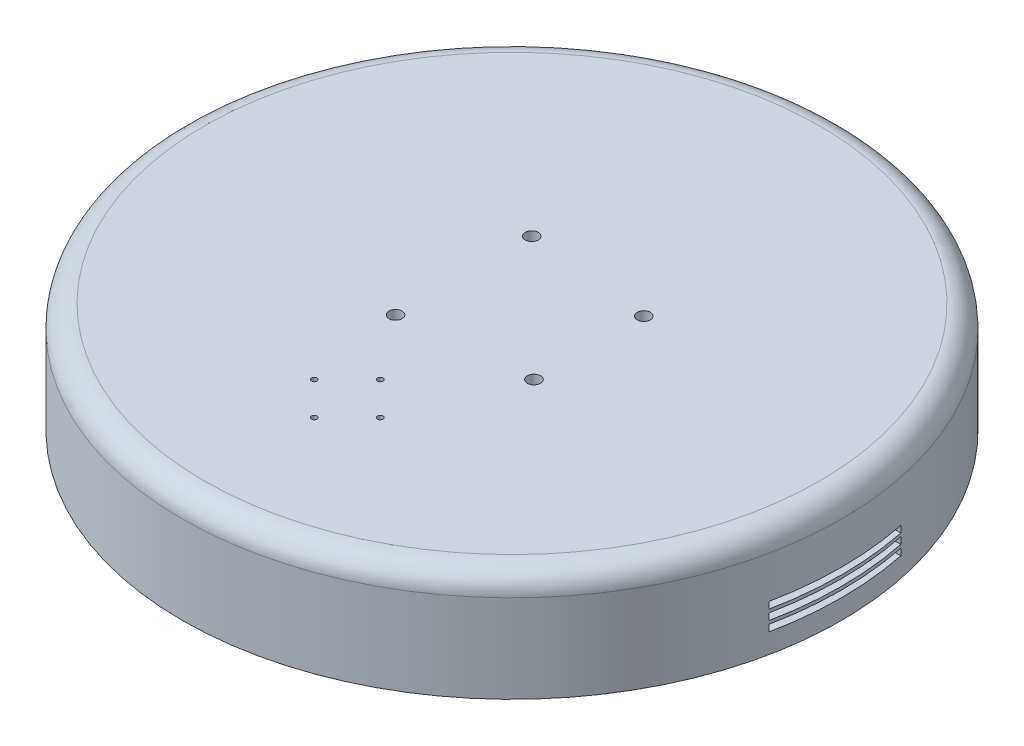
ISO-10303-21;
HEADER;
FILE_DESCRIPTION(('STEP AP214'),'2;1');
FILE_NAME('part.step','',(''),(''),'','','');
FILE_SCHEMA(('AUTOMOTIVE_DESIGN { 1 0 10303 214 1 1 1 1 }'));
ENDSEC;
DATA;
#1=APPLICATION_CONTEXT('core data for automotive mechanical design processes');
#2=APPLICATION_PROTOCOL_DEFINITION('international standard','automotive_design',2000,#1);
#3=PRODUCT_CONTEXT('',#1,'mechanical');
#4=PRODUCT('Part','Part','',(#3));
#5=PRODUCT_RELATED_PRODUCT_CATEGORY('part','',(#4));
#6=PRODUCT_DEFINITION_FORMATION('','',#4);
#7=PRODUCT_DEFINITION_CONTEXT('part definition',#1,'design');
#8=PRODUCT_DEFINITION('design','',#6,#7);
#9=PRODUCT_DEFINITION_SHAPE('','',#8);
#10=(LENGTH_UNIT() NAMED_UNIT(*) SI_UNIT(.MILLI.,.METRE.));
#11=(NAMED_UNIT(*) PLANE_ANGLE_UNIT() SI_UNIT($,.RADIAN.));
#12=(NAMED_UNIT(*) SI_UNIT($,.STERADIAN.) SOLID_ANGLE_UNIT());
#13=UNCERTAINTY_MEASURE_WITH_UNIT(LENGTH_MEASURE(1.E-05),#10,'distance_accuracy_value','');
#14=(GEOMETRIC_REPRESENTATION_CONTEXT(3) GLOBAL_UNCERTAINTY_ASSIGNED_CONTEXT((#13)) GLOBAL_UNIT_ASSIGNED_CONTEXT((#10,
#11,#12)) REPRESENTATION_CONTEXT('',''));
#15=CARTESIAN_POINT('',(0.,0.,0.));
#16=DIRECTION('',(0.,0.,1.));
#17=DIRECTION('',(1.,0.,0.));
#18=AXIS2_PLACEMENT_3D('',#15,#16,#17);
#19=CARTESIAN_POINT('',(0.,50.,0.));
#20=DIRECTION('',(0.,-1.,0.));
#21=DIRECTION('',(0.,0.,-1.));
#22=AXIS2_PLACEMENT_3D('',#19,#20,#21);
#23=CYLINDRICAL_SURFACE('',#22,150.);
#24=DIRECTION('',(0.,-1.,0.));
#25=VECTOR('',#24,1.);
#26=CARTESIAN_POINT('',(-146.969384566991,50.,-30.));
#27=LINE('',#26,#25);
#28=CARTESIAN_POINT('',(-146.969384566991,18.,-30.));
#29=VERTEX_POINT('',#28);
#30=CARTESIAN_POINT('',(-146.969384566991,21.,-30.));
#31=VERTEX_POINT('',#30);
#32=EDGE_CURVE('E405',#29,#31,#27,.F.);
#33=ORIENTED_EDGE('',*,*,#32,.T.);
#34=CARTESIAN_POINT('',(0.,21.,0.));
#35=DIRECTION('',(0.,1.,0.));
#36=DIRECTION('',(0.,0.,1.));
#37=AXIS2_PLACEMENT_3D('',#34,#35,#36);
#38=CIRCLE('',#37,150.);
#39=CARTESIAN_POINT('',(-146.969384566991,21.,30.));
#40=VERTEX_POINT('',#39);
#41=EDGE_CURVE('E54',#31,#40,#38,.T.);
#42=ORIENTED_EDGE('',*,*,#41,.T.);
#43=DIRECTION('',(0.,-1.,0.));
#44=VECTOR('',#43,1.);
#45=CARTESIAN_POINT('',(-146.969384566991,50.,30.));
#46=LINE('',#45,#44);
#47=CARTESIAN_POINT('',(-146.969384566991,18.,30.));
#48=VERTEX_POINT('',#47);
#49=EDGE_CURVE('E398',#40,#48,#46,.T.);
#50=ORIENTED_EDGE('',*,*,#49,.T.);
#51=CARTESIAN_POINT('',(0.,18.,0.));
#52=DIRECTION('',(0.,-1.,0.));
#53=DIRECTION('',(0.,0.,-1.));
#54=AXIS2_PLACEMENT_3D('',#51,#52,#53);
#55=CIRCLE('',#54,150.);
#56=EDGE_CURVE('E401',#48,#29,#55,.T.);
#57=ORIENTED_EDGE('',*,*,#56,.T.);
#58=EDGE_LOOP('',(#33,#42,#50,#57));
#59=FACE_BOUND('',#58,.T.);
#60=DIRECTION('',(0.,-1.,0.));
#61=VECTOR('',#60,1.);
#62=CARTESIAN_POINT('',(146.969384566991,50.,30.));
#63=LINE('',#62,#61);
#64=CARTESIAN_POINT('',(146.969384566991,18.,30.));
#65=VERTEX_POINT('',#64);
#66=CARTESIAN_POINT('',(146.969384566991,21.,30.));
#67=VERTEX_POINT('',#66);
#68=EDGE_CURVE('E318',#65,#67,#63,.F.);
#69=ORIENTED_EDGE('',*,*,#68,.T.);
#70=CARTESIAN_POINT('',(146.969384566991,21.,-30.));
#71=VERTEX_POINT('',#70);
#72=EDGE_CURVE('E62',#67,#71,#38,.T.);
#73=ORIENTED_EDGE('',*,*,#72,.T.);
#74=DIRECTION('',(0.,-1.,0.));
#75=VECTOR('',#74,1.);
#76=CARTESIAN_POINT('',(146.969384566991,50.,-30.));
#77=LINE('',#76,#75);
#78=CARTESIAN_POINT('',(146.969384566991,18.,-30.));
#79=VERTEX_POINT('',#78);
#80=EDGE_CURVE('E305',#71,#79,#77,.T.);
#81=ORIENTED_EDGE('',*,*,#80,.T.);
#82=EDGE_CURVE('E402',#79,#65,#55,.T.);
#83=ORIENTED_EDGE('',*,*,#82,.T.);
#84=EDGE_LOOP('',(#69,#73,#81,#83));
#85=FACE_BOUND('',#84,.T.);
#86=DIRECTION('',(0.,-1.,0.));
#87=VECTOR('',#86,1.);
#88=CARTESIAN_POINT('',(-146.969384566991,50.,-30.));
#89=LINE('',#88,#87);
#90=CARTESIAN_POINT('',(-146.969384566991,9.,-30.));
#91=VERTEX_POINT('',#90);
#92=CARTESIAN_POINT('',(-146.969384566991,12.,-30.));
#93=VERTEX_POINT('',#92);
#94=EDGE_CURVE('E386',#91,#93,#89,.F.);
#95=ORIENTED_EDGE('',*,*,#94,.T.);
#96=CARTESIAN_POINT('',(0.,12.,0.));
#97=DIRECTION('',(0.,1.,0.));
#98=DIRECTION('',(0.,0.,1.));
#99=AXIS2_PLACEMENT_3D('',#96,#97,#98);
#100=CIRCLE('',#99,150.);
#101=CARTESIAN_POINT('',(-146.969384566991,12.,30.));
#102=VERTEX_POINT('',#101);
#103=EDGE_CURVE('E370',#93,#102,#100,.T.);
#104=ORIENTED_EDGE('',*,*,#103,.T.);
#105=DIRECTION('',(0.,-1.,0.));
#106=VECTOR('',#105,1.);
#107=CARTESIAN_POINT('',(-146.969384566991,50.,30.));
#108=LINE('',#107,#106);
#109=CARTESIAN_POINT('',(-146.969384566991,9.,30.));
#110=VERTEX_POINT('',#109);
#111=EDGE_CURVE('E378',#102,#110,#108,.T.);
#112=ORIENTED_EDGE('',*,*,#111,.T.);
#113=CARTESIAN_POINT('',(0.,9.,0.));
#114=DIRECTION('',(0.,-1.,0.));
#115=DIRECTION('',(0.,0.,-1.));
#116=AXIS2_PLACEMENT_3D('',#113,#114,#115);
#117=CIRCLE('',#116,150.);
#118=EDGE_CURVE('E382',#110,#91,#117,.T.);
#119=ORIENTED_EDGE('',*,*,#118,.T.);
#120=EDGE_LOOP('',(#95,#104,#112,#119));
#121=FACE_BOUND('',#120,.T.);
#122=DIRECTION('',(0.,-1.,0.));
#123=VECTOR('',#122,1.);
#124=CARTESIAN_POINT('',(146.969384566991,50.,30.));
#125=LINE('',#124,#123);
#126=CARTESIAN_POINT('',(146.969384566991,9.,30.));
#127=VERTEX_POINT('',#126);
#128=CARTESIAN_POINT('',(146.969384566991,12.,30.));
#129=VERTEX_POINT('',#128);
#130=EDGE_CURVE('E374',#127,#129,#125,.F.);
#131=ORIENTED_EDGE('',*,*,#130,.T.);
#132=CARTESIAN_POINT('',(146.969384566991,12.,-30.));
#133=VERTEX_POINT('',#132);
#134=EDGE_CURVE('E371',#129,#133,#100,.T.);
#135=ORIENTED_EDGE('',*,*,#134,.T.);
#136=DIRECTION('',(0.,-1.,0.));
#137=VECTOR('',#136,1.);
#138=CARTESIAN_POINT('',(146.969384566991,50.,-30.));
#139=LINE('',#138,#137);
#140=CARTESIAN_POINT('',(146.969384566991,9.,-30.));
#141=VERTEX_POINT('',#140);
#142=EDGE_CURVE('E390',#133,#141,#139,.T.);
#143=ORIENTED_EDGE('',*,*,#142,.T.);
#144=EDGE_CURVE('E383',#141,#127,#117,.T.);
#145=ORIENTED_EDGE('',*,*,#144,.T.);
#146=EDGE_LOOP('',(#131,#135,#143,#145));
#147=FACE_BOUND('',#146,.T.);
#148=DIRECTION('',(0.,-1.,0.));
#149=VECTOR('',#148,1.);
#150=CARTESIAN_POINT('',(-146.969384566991,50.,-30.));
#151=LINE('',#150,#149);
#152=CARTESIAN_POINT('',(-146.969384566991,13.5,-30.));
#153=VERTEX_POINT('',#152);
#154=CARTESIAN_POINT('',(-146.969384566991,16.5,-30.));
#155=VERTEX_POINT('',#154);
#156=EDGE_CURVE('E362',#153,#155,#151,.F.);
#157=ORIENTED_EDGE('',*,*,#156,.T.);
#158=CARTESIAN_POINT('',(0.,16.5,0.));
#159=DIRECTION('',(0.,1.,0.));
#160=DIRECTION('',(0.,0.,1.));
#161=AXIS2_PLACEMENT_3D('',#158,#159,#160);
#162=CIRCLE('',#161,150.);
#163=CARTESIAN_POINT('',(-146.969384566991,16.5,30.));
#164=VERTEX_POINT('',#163);
#165=EDGE_CURVE('E352',#155,#164,#162,.T.);
#166=ORIENTED_EDGE('',*,*,#165,.T.);
#167=DIRECTION('',(0.,-1.,0.));
#168=VECTOR('',#167,1.);
#169=CARTESIAN_POINT('',(-146.969384566991,50.,30.));
#170=LINE('',#169,#168);
#171=CARTESIAN_POINT('',(-146.969384566991,13.5,30.));
#172=VERTEX_POINT('',#171);
#173=EDGE_CURVE('E222',#164,#172,#170,.T.);
#174=ORIENTED_EDGE('',*,*,#173,.T.);
#175=CARTESIAN_POINT('',(0.,13.5,0.));
#176=DIRECTION('',(0.,-1.,0.));
#177=DIRECTION('',(0.,0.,-1.));
#178=AXIS2_PLACEMENT_3D('',#175,#176,#177);
#179=CIRCLE('',#178,150.);
#180=EDGE_CURVE('E358',#172,#153,#179,.T.);
#181=ORIENTED_EDGE('',*,*,#180,.T.);
#182=EDGE_LOOP('',(#157,#166,#174,#181));
#183=FACE_BOUND('',#182,.T.);
#184=DIRECTION('',(0.,-1.,0.));
#185=VECTOR('',#184,1.);
#186=CARTESIAN_POINT('',(146.969384566991,50.,30.));
#187=LINE('',#186,#185);
#188=CARTESIAN_POINT('',(146.969384566991,13.5,30.));
#189=VERTEX_POINT('',#188);
#190=CARTESIAN_POINT('',(146.969384566991,16.5,30.));
#191=VERTEX_POINT('',#190);
#192=EDGE_CURVE('E351',#189,#191,#187,.F.);
#193=ORIENTED_EDGE('',*,*,#192,.T.);
#194=CARTESIAN_POINT('',(146.969384566991,16.5,-30.));
#195=VERTEX_POINT('',#194);
#196=EDGE_CURVE('E348',#191,#195,#162,.T.);
#197=ORIENTED_EDGE('',*,*,#196,.T.);
#198=DIRECTION('',(0.,-1.,0.));
#199=VECTOR('',#198,1.);
#200=CARTESIAN_POINT('',(146.969384566991,50.,-30.));
#201=LINE('',#200,#199);
#202=CARTESIAN_POINT('',(146.969384566991,13.5,-30.));
#203=VERTEX_POINT('',#202);
#204=EDGE_CURVE('E366',#195,#203,#201,.T.);
#205=ORIENTED_EDGE('',*,*,#204,.T.);
#206=EDGE_CURVE('E359',#203,#189,#179,.T.);
#207=ORIENTED_EDGE('',*,*,#206,.T.);
#208=EDGE_LOOP('',(#193,#197,#205,#207));
#209=FACE_BOUND('',#208,.T.);
#210=CARTESIAN_POINT('',(0.,40.,0.));
#211=DIRECTION('',(0.,1.,0.));
#212=DIRECTION('',(0.,0.,1.));
#213=AXIS2_PLACEMENT_3D('',#210,#211,#212);
#214=CIRCLE('',#213,150.);
#215=CARTESIAN_POINT('',(0.,40.,150.));
#216=VERTEX_POINT('',#215);
#217=EDGE_CURVE('E214',#216,#216,#214,.F.);
#218=ORIENTED_EDGE('',*,*,#217,.T.);
#219=EDGE_LOOP('',(#218));
#220=FACE_BOUND('',#219,.T.);
#221=CARTESIAN_POINT('',(0.,0.,0.));
#222=DIRECTION('',(0.,1.,0.));
#223=DIRECTION('',(0.,0.,1.));
#224=AXIS2_PLACEMENT_3D('',#221,#222,#223);
#225=CIRCLE('',#224,150.);
#226=CARTESIAN_POINT('',(0.,0.,150.));
#227=VERTEX_POINT('',#226);
#228=EDGE_CURVE('E454',#227,#227,#225,.T.);
#229=ORIENTED_EDGE('',*,*,#228,.T.);
#230=EDGE_LOOP('',(#229));
#231=FACE_BOUND('',#230,.T.);
#232=ADVANCED_FACE('F38',(#59,#85,#121,#147,#183,#209,#220,#231),#23,.T.);
#233=CARTESIAN_POINT('',(0.,50.,0.));
#234=DIRECTION('',(0.,1.,0.));
#235=DIRECTION('',(0.,0.,1.));
#236=AXIS2_PLACEMENT_3D('',#233,#234,#235);
#237=PLANE('',#236);
#238=CARTESIAN_POINT('',(0.,50.,90.));
#239=DIRECTION('',(0.,1.,0.));
#240=DIRECTION('',(0.,0.,1.));
#241=AXIS2_PLACEMENT_3D('',#238,#239,#240);
#242=CIRCLE('',#241,1.25);
#243=CARTESIAN_POINT('',(0.,50.,91.25));
#244=VERTEX_POINT('',#243);
#245=EDGE_CURVE('E446',#244,#244,#242,.T.);
#246=ORIENTED_EDGE('',*,*,#245,.F.);
#247=EDGE_LOOP('',(#246));
#248=FACE_BOUND('',#247,.T.);
#249=CARTESIAN_POINT('',(35.,50.,25.));
#250=DIRECTION('',(0.,1.,0.));
#251=DIRECTION('',(0.,0.,1.));
#252=AXIS2_PLACEMENT_3D('',#249,#250,#251);
#253=CIRCLE('',#252,3.);
#254=CARTESIAN_POINT('',(35.,50.,28.));
#255=VERTEX_POINT('',#254);
#256=EDGE_CURVE('E441',#255,#255,#253,.T.);
#257=ORIENTED_EDGE('',*,*,#256,.F.);
#258=EDGE_LOOP('',(#257));
#259=FACE_BOUND('',#258,.T.);
#260=CARTESIAN_POINT('',(-22.,50.,31.));
#261=DIRECTION('',(0.,1.,0.));
#262=DIRECTION('',(0.,0.,1.));
#263=AXIS2_PLACEMENT_3D('',#260,#261,#262);
#264=CIRCLE('',#263,3.);
#265=CARTESIAN_POINT('',(-22.,50.,34.));
#266=VERTEX_POINT('',#265);
#267=EDGE_CURVE('E436',#266,#266,#264,.T.);
#268=ORIENTED_EDGE('',*,*,#267,.F.);
#269=EDGE_LOOP('',(#268));
#270=FACE_BOUND('',#269,.T.);
#271=CARTESIAN_POINT('',(35.,50.,-25.));
#272=DIRECTION('',(0.,1.,0.));
#273=DIRECTION('',(0.,0.,1.));
#274=AXIS2_PLACEMENT_3D('',#271,#272,#273);
#275=CIRCLE('',#274,3.);
#276=CARTESIAN_POINT('',(35.,50.,-22.));
#277=VERTEX_POINT('',#276);
#278=EDGE_CURVE('E431',#277,#277,#275,.T.);
#279=ORIENTED_EDGE('',*,*,#278,.F.);
#280=EDGE_LOOP('',(#279));
#281=FACE_BOUND('',#280,.T.);
#282=CARTESIAN_POINT('',(0.,50.,60.));
#283=DIRECTION('',(0.,1.,0.));
#284=DIRECTION('',(0.,0.,1.));
#285=AXIS2_PLACEMENT_3D('',#282,#283,#284);
#286=CIRCLE('',#285,1.25);
#287=CARTESIAN_POINT('',(0.,50.,61.25));
#288=VERTEX_POINT('',#287);
#289=EDGE_CURVE('E426',#288,#288,#286,.T.);
#290=ORIENTED_EDGE('',*,*,#289,.F.);
#291=EDGE_LOOP('',(#290));
#292=FACE_BOUND('',#291,.T.);
#293=CARTESIAN_POINT('',(-15.,50.,75.));
#294=DIRECTION('',(0.,1.,0.));
#295=DIRECTION('',(0.,0.,1.));
#296=AXIS2_PLACEMENT_3D('',#293,#294,#295);
#297=CIRCLE('',#296,1.25);
#298=CARTESIAN_POINT('',(-15.,50.,76.25));
#299=VERTEX_POINT('',#298);
#300=EDGE_CURVE('E421',#299,#299,#297,.T.);
#301=ORIENTED_EDGE('',*,*,#300,.F.);
#302=EDGE_LOOP('',(#301));
#303=FACE_BOUND('',#302,.T.);
#304=CARTESIAN_POINT('',(15.,50.,75.));
#305=DIRECTION('',(0.,1.,0.));
#306=DIRECTION('',(0.,0.,1.));
#307=AXIS2_PLACEMENT_3D('',#304,#305,#306);
#308=CIRCLE('',#307,1.25);
#309=CARTESIAN_POINT('',(15.,50.,76.25));
#310=VERTEX_POINT('',#309);
#311=EDGE_CURVE('E416',#310,#310,#308,.T.);
#312=ORIENTED_EDGE('',*,*,#311,.F.);
#313=EDGE_LOOP('',(#312));
#314=FACE_BOUND('',#313,.T.);
#315=CARTESIAN_POINT('',(-22.,50.,-31.));
#316=DIRECTION('',(0.,1.,0.));
#317=DIRECTION('',(0.,0.,1.));
#318=AXIS2_PLACEMENT_3D('',#315,#316,#317);
#319=CIRCLE('',#318,3.);
#320=CARTESIAN_POINT('',(-22.,50.,-28.));
#321=VERTEX_POINT('',#320);
#322=EDGE_CURVE('E411',#321,#321,#319,.T.);
#323=ORIENTED_EDGE('',*,*,#322,.F.);
#324=EDGE_LOOP('',(#323));
#325=FACE_BOUND('',#324,.T.);
#326=CARTESIAN_POINT('',(0.,50.,0.));
#327=DIRECTION('',(0.,1.,0.));
#328=DIRECTION('',(0.,0.,1.));
#329=AXIS2_PLACEMENT_3D('',#326,#327,#328);
#330=CIRCLE('',#329,140.);
#331=CARTESIAN_POINT('',(0.,50.,140.));
#332=VERTEX_POINT('',#331);
#333=EDGE_CURVE('E466',#332,#332,#330,.T.);
#334=ORIENTED_EDGE('',*,*,#333,.T.);
#335=EDGE_LOOP('',(#334));
#336=FACE_BOUND('',#335,.T.);
#337=ADVANCED_FACE('F516',(#248,#259,#270,#281,#292,#303,#314,#325,#336),#237,.T.);
#338=CARTESIAN_POINT('',(0.,0.,0.));
#339=DIRECTION('',(0.,1.,0.));
#340=DIRECTION('',(0.,0.,1.));
#341=AXIS2_PLACEMENT_3D('',#338,#339,#340);
#342=PLANE('',#341);
#343=CARTESIAN_POINT('',(0.,0.,0.));
#344=DIRECTION('',(0.,1.,0.));
#345=DIRECTION('',(0.,0.,1.));
#346=AXIS2_PLACEMENT_3D('',#343,#344,#345);
#347=CIRCLE('',#346,145.);
#348=CARTESIAN_POINT('',(0.,0.,145.));
#349=VERTEX_POINT('',#348);
#350=EDGE_CURVE('E450',#349,#349,#347,.T.);
#351=ORIENTED_EDGE('',*,*,#350,.T.);
#352=EDGE_LOOP('',(#351));
#353=FACE_BOUND('',#352,.T.);
#354=ORIENTED_EDGE('',*,*,#228,.F.);
#355=EDGE_LOOP('',(#354));
#356=FACE_BOUND('',#355,.T.);
#357=ADVANCED_FACE('F522',(#353,#356),#342,.F.);
#358=CARTESIAN_POINT('',(0.,50.,0.));
#359=DIRECTION('',(0.,-1.,0.));
#360=DIRECTION('',(0.,0.,-1.));
#361=AXIS2_PLACEMENT_3D('',#358,#359,#360);
#362=CYLINDRICAL_SURFACE('',#361,145.);
#363=DIRECTION('',(0.,-1.,0.));
#364=VECTOR('',#363,1.);
#365=CARTESIAN_POINT('',(141.862609591111,50.,-30.));
#366=LINE('',#365,#364);
#367=CARTESIAN_POINT('',(141.862609591111,21.,-30.));
#368=VERTEX_POINT('',#367);
#369=CARTESIAN_POINT('',(141.862609591111,18.,-30.));
#370=VERTEX_POINT('',#369);
#371=EDGE_CURVE('E11',#368,#370,#366,.T.);
#372=ORIENTED_EDGE('',*,*,#371,.F.);
#373=CARTESIAN_POINT('',(0.,21.,0.));
#374=DIRECTION('',(0.,1.,0.));
#375=DIRECTION('',(0.,0.,1.));
#376=AXIS2_PLACEMENT_3D('',#373,#374,#375);
#377=CIRCLE('',#376,145.);
#378=CARTESIAN_POINT('',(141.862609591111,21.,30.));
#379=VERTEX_POINT('',#378);
#380=EDGE_CURVE('E274',#379,#368,#377,.T.);
#381=ORIENTED_EDGE('',*,*,#380,.F.);
#382=DIRECTION('',(0.,-1.,0.));
#383=VECTOR('',#382,1.);
#384=CARTESIAN_POINT('',(141.862609591111,50.,30.));
#385=LINE('',#384,#383);
#386=CARTESIAN_POINT('',(141.862609591111,18.,30.));
#387=VERTEX_POINT('',#386);
#388=EDGE_CURVE('E283',#387,#379,#385,.F.);
#389=ORIENTED_EDGE('',*,*,#388,.F.);
#390=CARTESIAN_POINT('',(0.,18.,0.));
#391=DIRECTION('',(0.,-1.,0.));
#392=DIRECTION('',(0.,0.,-1.));
#393=AXIS2_PLACEMENT_3D('',#390,#391,#392);
#394=CIRCLE('',#393,145.);
#395=EDGE_CURVE('E47',#370,#387,#394,.T.);
#396=ORIENTED_EDGE('',*,*,#395,.F.);
#397=EDGE_LOOP('',(#372,#381,#389,#396));
#398=FACE_BOUND('',#397,.T.);
#399=DIRECTION('',(0.,-1.,0.));
#400=VECTOR('',#399,1.);
#401=CARTESIAN_POINT('',(-141.862609591111,50.,-30.));
#402=LINE('',#401,#400);
#403=CARTESIAN_POINT('',(-141.862609591111,18.,-30.));
#404=VERTEX_POINT('',#403);
#405=CARTESIAN_POINT('',(-141.862609591111,21.,-30.));
#406=VERTEX_POINT('',#405);
#407=EDGE_CURVE('E280',#404,#406,#402,.F.);
#408=ORIENTED_EDGE('',*,*,#407,.F.);
#409=CARTESIAN_POINT('',(-141.862609591111,18.,30.));
#410=VERTEX_POINT('',#409);
#411=EDGE_CURVE('E277',#410,#404,#394,.T.);
#412=ORIENTED_EDGE('',*,*,#411,.F.);
#413=DIRECTION('',(0.,-1.,0.));
#414=VECTOR('',#413,1.);
#415=CARTESIAN_POINT('',(-141.862609591111,50.,30.));
#416=LINE('',#415,#414);
#417=CARTESIAN_POINT('',(-141.862609591111,21.,30.));
#418=VERTEX_POINT('',#417);
#419=EDGE_CURVE('E273',#418,#410,#416,.T.);
#420=ORIENTED_EDGE('',*,*,#419,.F.);
#421=EDGE_CURVE('E270',#406,#418,#377,.T.);
#422=ORIENTED_EDGE('',*,*,#421,.F.);
#423=EDGE_LOOP('',(#408,#412,#420,#422));
#424=FACE_BOUND('',#423,.T.);
#425=DIRECTION('',(0.,-1.,0.));
#426=VECTOR('',#425,1.);
#427=CARTESIAN_POINT('',(141.862609591111,50.,-30.));
#428=LINE('',#427,#426);
#429=CARTESIAN_POINT('',(141.862609591111,12.,-30.));
#430=VERTEX_POINT('',#429);
#431=CARTESIAN_POINT('',(141.862609591111,9.,-30.));
#432=VERTEX_POINT('',#431);
#433=EDGE_CURVE('E267',#430,#432,#428,.T.);
#434=ORIENTED_EDGE('',*,*,#433,.F.);
#435=CARTESIAN_POINT('',(0.,12.,0.));
#436=DIRECTION('',(0.,1.,0.));
#437=DIRECTION('',(0.,0.,1.));
#438=AXIS2_PLACEMENT_3D('',#435,#436,#437);
#439=CIRCLE('',#438,145.);
#440=CARTESIAN_POINT('',(141.862609591111,12.,30.));
#441=VERTEX_POINT('',#440);
#442=EDGE_CURVE('E252',#441,#430,#439,.T.);
#443=ORIENTED_EDGE('',*,*,#442,.F.);
#444=DIRECTION('',(0.,-1.,0.));
#445=VECTOR('',#444,1.);
#446=CARTESIAN_POINT('',(141.862609591111,50.,30.));
#447=LINE('',#446,#445);
#448=CARTESIAN_POINT('',(141.862609591111,9.,30.));
#449=VERTEX_POINT('',#448);
#450=EDGE_CURVE('E263',#449,#441,#447,.F.);
#451=ORIENTED_EDGE('',*,*,#450,.F.);
#452=CARTESIAN_POINT('',(0.,9.,0.));
#453=DIRECTION('',(0.,-1.,0.));
#454=DIRECTION('',(0.,0.,-1.));
#455=AXIS2_PLACEMENT_3D('',#452,#453,#454);
#456=CIRCLE('',#455,145.);
#457=EDGE_CURVE('E259',#432,#449,#456,.T.);
#458=ORIENTED_EDGE('',*,*,#457,.F.);
#459=EDGE_LOOP('',(#434,#443,#451,#458));
#460=FACE_BOUND('',#459,.T.);
#461=DIRECTION('',(0.,-1.,0.));
#462=VECTOR('',#461,1.);
#463=CARTESIAN_POINT('',(-141.862609591111,50.,-30.));
#464=LINE('',#463,#462);
#465=CARTESIAN_POINT('',(-141.862609591111,9.,-30.));
#466=VERTEX_POINT('',#465);
#467=CARTESIAN_POINT('',(-141.862609591111,12.,-30.));
#468=VERTEX_POINT('',#467);
#469=EDGE_CURVE('E258',#466,#468,#464,.F.);
#470=ORIENTED_EDGE('',*,*,#469,.F.);
#471=CARTESIAN_POINT('',(-141.862609591111,9.,30.));
#472=VERTEX_POINT('',#471);
#473=EDGE_CURVE('E255',#472,#466,#456,.T.);
#474=ORIENTED_EDGE('',*,*,#473,.F.);
#475=DIRECTION('',(0.,-1.,0.));
#476=VECTOR('',#475,1.);
#477=CARTESIAN_POINT('',(-141.862609591111,50.,30.));
#478=LINE('',#477,#476);
#479=CARTESIAN_POINT('',(-141.862609591111,12.,30.));
#480=VERTEX_POINT('',#479);
#481=EDGE_CURVE('E251',#480,#472,#478,.T.);
#482=ORIENTED_EDGE('',*,*,#481,.F.);
#483=EDGE_CURVE('E248',#468,#480,#439,.T.);
#484=ORIENTED_EDGE('',*,*,#483,.F.);
#485=EDGE_LOOP('',(#470,#474,#482,#484));
#486=FACE_BOUND('',#485,.T.);
#487=DIRECTION('',(0.,-1.,0.));
#488=VECTOR('',#487,1.);
#489=CARTESIAN_POINT('',(141.862609591111,50.,-30.));
#490=LINE('',#489,#488);
#491=CARTESIAN_POINT('',(141.862609591111,16.5,-30.));
#492=VERTEX_POINT('',#491);
#493=CARTESIAN_POINT('',(141.862609591111,13.5,-30.));
#494=VERTEX_POINT('',#493);
#495=EDGE_CURVE('E245',#492,#494,#490,.T.);
#496=ORIENTED_EDGE('',*,*,#495,.F.);
#497=CARTESIAN_POINT('',(0.,16.5,0.));
#498=DIRECTION('',(0.,1.,0.));
#499=DIRECTION('',(0.,0.,1.));
#500=AXIS2_PLACEMENT_3D('',#497,#498,#499);
#501=CIRCLE('',#500,145.);
#502=CARTESIAN_POINT('',(141.862609591111,16.5,30.));
#503=VERTEX_POINT('',#502);
#504=EDGE_CURVE('E216',#503,#492,#501,.T.);
#505=ORIENTED_EDGE('',*,*,#504,.F.);
#506=DIRECTION('',(0.,-1.,0.));
#507=VECTOR('',#506,1.);
#508=CARTESIAN_POINT('',(141.862609591111,50.,30.));
#509=LINE('',#508,#507);
#510=CARTESIAN_POINT('',(141.862609591111,13.5,30.));
#511=VERTEX_POINT('',#510);
#512=EDGE_CURVE('E241',#511,#503,#509,.F.);
#513=ORIENTED_EDGE('',*,*,#512,.F.);
#514=CARTESIAN_POINT('',(0.,13.5,0.));
#515=DIRECTION('',(0.,-1.,0.));
#516=DIRECTION('',(0.,0.,-1.));
#517=AXIS2_PLACEMENT_3D('',#514,#515,#516);
#518=CIRCLE('',#517,145.);
#519=EDGE_CURVE('E236',#494,#511,#518,.T.);
#520=ORIENTED_EDGE('',*,*,#519,.F.);
#521=EDGE_LOOP('',(#496,#505,#513,#520));
#522=FACE_BOUND('',#521,.T.);
#523=DIRECTION('',(0.,-1.,0.));
#524=VECTOR('',#523,1.);
#525=CARTESIAN_POINT('',(-141.862609591111,50.,-30.));
#526=LINE('',#525,#524);
#527=CARTESIAN_POINT('',(-141.862609591111,13.5,-30.));
#528=VERTEX_POINT('',#527);
#529=CARTESIAN_POINT('',(-141.862609591111,16.5,-30.));
#530=VERTEX_POINT('',#529);
#531=EDGE_CURVE('E234',#528,#530,#526,.F.);
#532=ORIENTED_EDGE('',*,*,#531,.F.);
#533=CARTESIAN_POINT('',(-141.862609591111,13.5,30.));
#534=VERTEX_POINT('',#533);
#535=EDGE_CURVE('E230',#534,#528,#518,.T.);
#536=ORIENTED_EDGE('',*,*,#535,.F.);
#537=DIRECTION('',(0.,-1.,0.));
#538=VECTOR('',#537,1.);
#539=CARTESIAN_POINT('',(-141.862609591111,50.,30.));
#540=LINE('',#539,#538);
#541=CARTESIAN_POINT('',(-141.862609591111,16.5,30.));
#542=VERTEX_POINT('',#541);
#543=EDGE_CURVE('E213',#542,#534,#540,.T.);
#544=ORIENTED_EDGE('',*,*,#543,.F.);
#545=EDGE_CURVE('E201',#530,#542,#501,.T.);
#546=ORIENTED_EDGE('',*,*,#545,.F.);
#547=EDGE_LOOP('',(#532,#536,#544,#546));
#548=FACE_BOUND('',#547,.T.);
#549=CARTESIAN_POINT('',(0.,35.,0.));
#550=DIRECTION('',(0.,1.,0.));
#551=DIRECTION('',(0.,0.,1.));
#552=AXIS2_PLACEMENT_3D('',#549,#550,#551);
#553=CIRCLE('',#552,145.);
#554=CARTESIAN_POINT('',(0.,35.,145.));
#555=VERTEX_POINT('',#554);
#556=EDGE_CURVE('E458',#555,#555,#553,.T.);
#557=ORIENTED_EDGE('',*,*,#556,.T.);
#558=EDGE_LOOP('',(#557));
#559=FACE_BOUND('',#558,.T.);
#560=ORIENTED_EDGE('',*,*,#350,.F.);
#561=EDGE_LOOP('',(#560));
#562=FACE_BOUND('',#561,.T.);
#563=ADVANCED_FACE('F228',(#398,#424,#460,#486,#522,#548,#559,#562),#362,.F.);
#564=CARTESIAN_POINT('',(0.,45.,0.));
#565=DIRECTION('',(0.,1.,0.));
#566=DIRECTION('',(0.,0.,1.));
#567=AXIS2_PLACEMENT_3D('',#564,#565,#566);
#568=PLANE('',#567);
#569=CARTESIAN_POINT('',(0.,45.,90.));
#570=DIRECTION('',(0.,1.,0.));
#571=DIRECTION('',(0.,0.,1.));
#572=AXIS2_PLACEMENT_3D('',#569,#570,#571);
#573=CIRCLE('',#572,1.25);
#574=CARTESIAN_POINT('',(0.,45.,91.25));
#575=VERTEX_POINT('',#574);
#576=EDGE_CURVE('E445',#575,#575,#573,.T.);
#577=ORIENTED_EDGE('',*,*,#576,.T.);
#578=EDGE_LOOP('',(#577));
#579=FACE_BOUND('',#578,.T.);
#580=CARTESIAN_POINT('',(35.,45.,25.));
#581=DIRECTION('',(0.,1.,0.));
#582=DIRECTION('',(0.,0.,1.));
#583=AXIS2_PLACEMENT_3D('',#580,#581,#582);
#584=CIRCLE('',#583,3.);
#585=CARTESIAN_POINT('',(35.,45.,28.));
#586=VERTEX_POINT('',#585);
#587=EDGE_CURVE('E440',#586,#586,#584,.T.);
#588=ORIENTED_EDGE('',*,*,#587,.T.);
#589=EDGE_LOOP('',(#588));
#590=FACE_BOUND('',#589,.T.);
#591=CARTESIAN_POINT('',(-22.,45.,31.));
#592=DIRECTION('',(0.,1.,0.));
#593=DIRECTION('',(0.,0.,1.));
#594=AXIS2_PLACEMENT_3D('',#591,#592,#593);
#595=CIRCLE('',#594,3.);
#596=CARTESIAN_POINT('',(-22.,45.,34.));
#597=VERTEX_POINT('',#596);
#598=EDGE_CURVE('E435',#597,#597,#595,.T.);
#599=ORIENTED_EDGE('',*,*,#598,.T.);
#600=EDGE_LOOP('',(#599));
#601=FACE_BOUND('',#600,.T.);
#602=CARTESIAN_POINT('',(35.,45.,-25.));
#603=DIRECTION('',(0.,1.,0.));
#604=DIRECTION('',(0.,0.,1.));
#605=AXIS2_PLACEMENT_3D('',#602,#603,#604);
#606=CIRCLE('',#605,3.);
#607=CARTESIAN_POINT('',(35.,45.,-22.));
#608=VERTEX_POINT('',#607);
#609=EDGE_CURVE('E430',#608,#608,#606,.T.);
#610=ORIENTED_EDGE('',*,*,#609,.T.);
#611=EDGE_LOOP('',(#610));
#612=FACE_BOUND('',#611,.T.);
#613=CARTESIAN_POINT('',(0.,45.,60.));
#614=DIRECTION('',(0.,1.,0.));
#615=DIRECTION('',(0.,0.,1.));
#616=AXIS2_PLACEMENT_3D('',#613,#614,#615);
#617=CIRCLE('',#616,1.25);
#618=CARTESIAN_POINT('',(0.,45.,61.25));
#619=VERTEX_POINT('',#618);
#620=EDGE_CURVE('E425',#619,#619,#617,.T.);
#621=ORIENTED_EDGE('',*,*,#620,.T.);
#622=EDGE_LOOP('',(#621));
#623=FACE_BOUND('',#622,.T.);
#624=CARTESIAN_POINT('',(-15.,45.,75.));
#625=DIRECTION('',(0.,1.,0.));
#626=DIRECTION('',(0.,0.,1.));
#627=AXIS2_PLACEMENT_3D('',#624,#625,#626);
#628=CIRCLE('',#627,1.25);
#629=CARTESIAN_POINT('',(-15.,45.,76.25));
#630=VERTEX_POINT('',#629);
#631=EDGE_CURVE('E420',#630,#630,#628,.T.);
#632=ORIENTED_EDGE('',*,*,#631,.T.);
#633=EDGE_LOOP('',(#632));
#634=FACE_BOUND('',#633,.T.);
#635=CARTESIAN_POINT('',(15.,45.,75.));
#636=DIRECTION('',(0.,1.,0.));
#637=DIRECTION('',(0.,0.,1.));
#638=AXIS2_PLACEMENT_3D('',#635,#636,#637);
#639=CIRCLE('',#638,1.25);
#640=CARTESIAN_POINT('',(15.,45.,76.25));
#641=VERTEX_POINT('',#640);
#642=EDGE_CURVE('E415',#641,#641,#639,.T.);
#643=ORIENTED_EDGE('',*,*,#642,.T.);
#644=EDGE_LOOP('',(#643));
#645=FACE_BOUND('',#644,.T.);
#646=CARTESIAN_POINT('',(-22.,45.,-31.));
#647=DIRECTION('',(0.,1.,0.));
#648=DIRECTION('',(0.,0.,1.));
#649=AXIS2_PLACEMENT_3D('',#646,#647,#648);
#650=CIRCLE('',#649,3.);
#651=CARTESIAN_POINT('',(-22.,45.,-28.));
#652=VERTEX_POINT('',#651);
#653=EDGE_CURVE('E410',#652,#652,#650,.T.);
#654=ORIENTED_EDGE('',*,*,#653,.T.);
#655=EDGE_LOOP('',(#654));
#656=FACE_BOUND('',#655,.T.);
#657=CARTESIAN_POINT('',(0.,45.,0.));
#658=DIRECTION('',(0.,1.,0.));
#659=DIRECTION('',(0.,0.,1.));
#660=AXIS2_PLACEMENT_3D('',#657,#658,#659);
#661=CIRCLE('',#660,135.);
#662=CARTESIAN_POINT('',(0.,45.,135.));
#663=VERTEX_POINT('',#662);
#664=EDGE_CURVE('E462',#663,#663,#661,.F.);
#665=ORIENTED_EDGE('',*,*,#664,.T.);
#666=EDGE_LOOP('',(#665));
#667=FACE_BOUND('',#666,.T.);
#668=ADVANCED_FACE('F497',(#579,#590,#601,#612,#623,#634,#645,#656,#667),#568,.F.);
#669=CARTESIAN_POINT('',(0.,35.,0.));
#670=DIRECTION('',(0.,1.,0.));
#671=DIRECTION('',(0.,0.,1.));
#672=AXIS2_PLACEMENT_3D('',#669,#670,#671);
#673=TOROIDAL_SURFACE('',#672,135.,10.);
#674=ORIENTED_EDGE('',*,*,#664,.F.);
#675=EDGE_LOOP('',(#674));
#676=FACE_BOUND('',#675,.T.);
#677=ORIENTED_EDGE('',*,*,#556,.F.);
#678=EDGE_LOOP('',(#677));
#679=FACE_BOUND('',#678,.T.);
#680=ADVANCED_FACE('F526',(#676,#679),#673,.F.);
#681=CARTESIAN_POINT('',(0.,40.,0.));
#682=DIRECTION('',(0.,1.,0.));
#683=DIRECTION('',(0.,0.,1.));
#684=AXIS2_PLACEMENT_3D('',#681,#682,#683);
#685=TOROIDAL_SURFACE('',#684,140.,10.);
#686=ORIENTED_EDGE('',*,*,#217,.F.);
#687=EDGE_LOOP('',(#686));
#688=FACE_BOUND('',#687,.T.);
#689=ORIENTED_EDGE('',*,*,#333,.F.);
#690=EDGE_LOOP('',(#689));
#691=FACE_BOUND('',#690,.T.);
#692=ADVANCED_FACE('F40',(#688,#691),#685,.T.);
#693=CARTESIAN_POINT('',(-22.,0.,-31.));
#694=DIRECTION('',(0.,1.,0.));
#695=DIRECTION('',(0.,0.,1.));
#696=AXIS2_PLACEMENT_3D('',#693,#694,#695);
#697=CYLINDRICAL_SURFACE('',#696,3.);
#698=ORIENTED_EDGE('',*,*,#322,.T.);
#699=EDGE_LOOP('',(#698));
#700=FACE_BOUND('',#699,.T.);
#701=ORIENTED_EDGE('',*,*,#653,.F.);
#702=EDGE_LOOP('',(#701));
#703=FACE_BOUND('',#702,.T.);
#704=ADVANCED_FACE('F533',(#700,#703),#697,.F.);
#705=CARTESIAN_POINT('',(15.,0.,75.));
#706=DIRECTION('',(0.,1.,0.));
#707=DIRECTION('',(0.,0.,1.));
#708=AXIS2_PLACEMENT_3D('',#705,#706,#707);
#709=CYLINDRICAL_SURFACE('',#708,1.25);
#710=ORIENTED_EDGE('',*,*,#311,.T.);
#711=EDGE_LOOP('',(#710));
#712=FACE_BOUND('',#711,.T.);
#713=ORIENTED_EDGE('',*,*,#642,.F.);
#714=EDGE_LOOP('',(#713));
#715=FACE_BOUND('',#714,.T.);
#716=ADVANCED_FACE('F575',(#712,#715),#709,.F.);
#717=CARTESIAN_POINT('',(-15.,0.,75.));
#718=DIRECTION('',(0.,1.,0.));
#719=DIRECTION('',(0.,0.,1.));
#720=AXIS2_PLACEMENT_3D('',#717,#718,#719);
#721=CYLINDRICAL_SURFACE('',#720,1.25);
#722=ORIENTED_EDGE('',*,*,#300,.T.);
#723=EDGE_LOOP('',(#722));
#724=FACE_BOUND('',#723,.T.);
#725=ORIENTED_EDGE('',*,*,#631,.F.);
#726=EDGE_LOOP('',(#725));
#727=FACE_BOUND('',#726,.T.);
#728=ADVANCED_FACE('F586',(#724,#727),#721,.F.);
#729=CARTESIAN_POINT('',(0.,0.,60.));
#730=DIRECTION('',(0.,1.,0.));
#731=DIRECTION('',(0.,0.,1.));
#732=AXIS2_PLACEMENT_3D('',#729,#730,#731);
#733=CYLINDRICAL_SURFACE('',#732,1.25);
#734=ORIENTED_EDGE('',*,*,#289,.T.);
#735=EDGE_LOOP('',(#734));
#736=FACE_BOUND('',#735,.T.);
#737=ORIENTED_EDGE('',*,*,#620,.F.);
#738=EDGE_LOOP('',(#737));
#739=FACE_BOUND('',#738,.T.);
#740=ADVANCED_FACE('F596',(#736,#739),#733,.F.);
#741=CARTESIAN_POINT('',(35.,0.,-25.));
#742=DIRECTION('',(0.,1.,0.));
#743=DIRECTION('',(0.,0.,1.));
#744=AXIS2_PLACEMENT_3D('',#741,#742,#743);
#745=CYLINDRICAL_SURFACE('',#744,3.);
#746=ORIENTED_EDGE('',*,*,#278,.T.);
#747=EDGE_LOOP('',(#746));
#748=FACE_BOUND('',#747,.T.);
#749=ORIENTED_EDGE('',*,*,#609,.F.);
#750=EDGE_LOOP('',(#749));
#751=FACE_BOUND('',#750,.T.);
#752=ADVANCED_FACE('F606',(#748,#751),#745,.F.);
#753=CARTESIAN_POINT('',(-22.,0.,31.));
#754=DIRECTION('',(0.,1.,0.));
#755=DIRECTION('',(0.,0.,1.));
#756=AXIS2_PLACEMENT_3D('',#753,#754,#755);
#757=CYLINDRICAL_SURFACE('',#756,3.);
#758=ORIENTED_EDGE('',*,*,#267,.T.);
#759=EDGE_LOOP('',(#758));
#760=FACE_BOUND('',#759,.T.);
#761=ORIENTED_EDGE('',*,*,#598,.F.);
#762=EDGE_LOOP('',(#761));
#763=FACE_BOUND('',#762,.T.);
#764=ADVANCED_FACE('F511',(#760,#763),#757,.F.);
#765=CARTESIAN_POINT('',(35.,0.,25.));
#766=DIRECTION('',(0.,1.,0.));
#767=DIRECTION('',(0.,0.,1.));
#768=AXIS2_PLACEMENT_3D('',#765,#766,#767);
#769=CYLINDRICAL_SURFACE('',#768,3.);
#770=ORIENTED_EDGE('',*,*,#256,.T.);
#771=EDGE_LOOP('',(#770));
#772=FACE_BOUND('',#771,.T.);
#773=ORIENTED_EDGE('',*,*,#587,.F.);
#774=EDGE_LOOP('',(#773));
#775=FACE_BOUND('',#774,.T.);
#776=ADVANCED_FACE('F502',(#772,#775),#769,.F.);
#777=CARTESIAN_POINT('',(0.,0.,90.));
#778=DIRECTION('',(0.,1.,0.));
#779=DIRECTION('',(0.,0.,1.));
#780=AXIS2_PLACEMENT_3D('',#777,#778,#779);
#781=CYLINDRICAL_SURFACE('',#780,1.25);
#782=ORIENTED_EDGE('',*,*,#245,.T.);
#783=EDGE_LOOP('',(#782));
#784=FACE_BOUND('',#783,.T.);
#785=ORIENTED_EDGE('',*,*,#576,.F.);
#786=EDGE_LOOP('',(#785));
#787=FACE_BOUND('',#786,.T.);
#788=ADVANCED_FACE('F500',(#784,#787),#781,.F.);
#789=CARTESIAN_POINT('',(-150.,16.5,30.));
#790=DIRECTION('',(0.,1.,0.));
#791=DIRECTION('',(0.,0.,1.));
#792=AXIS2_PLACEMENT_3D('',#789,#790,#791);
#793=PLANE('',#792);
#794=DIRECTION('',(1.,0.,0.));
#795=VECTOR('',#794,1.);
#796=CARTESIAN_POINT('',(-150.,16.5,-30.));
#797=LINE('',#796,#795);
#798=EDGE_CURVE('E207',#155,#530,#797,.T.);
#799=ORIENTED_EDGE('',*,*,#798,.T.);
#800=ORIENTED_EDGE('',*,*,#545,.T.);
#801=DIRECTION('',(1.,0.,0.));
#802=VECTOR('',#801,1.);
#803=CARTESIAN_POINT('',(-150.,16.5,30.));
#804=LINE('',#803,#802);
#805=EDGE_CURVE('E204',#164,#542,#804,.T.);
#806=ORIENTED_EDGE('',*,*,#805,.F.);
#807=ORIENTED_EDGE('',*,*,#165,.F.);
#808=EDGE_LOOP('',(#799,#800,#806,#807));
#809=FACE_BOUND('',#808,.T.);
#810=ADVANCED_FACE('F203',(#809),#793,.F.);
#811=CARTESIAN_POINT('',(-150.,13.5,30.));
#812=DIRECTION('',(0.,0.,1.));
#813=DIRECTION('',(1.,0.,0.));
#814=AXIS2_PLACEMENT_3D('',#811,#812,#813);
#815=PLANE('',#814);
#816=ORIENTED_EDGE('',*,*,#805,.T.);
#817=ORIENTED_EDGE('',*,*,#543,.T.);
#818=DIRECTION('',(1.,0.,0.));
#819=VECTOR('',#818,1.);
#820=CARTESIAN_POINT('',(-150.,13.5,30.));
#821=LINE('',#820,#819);
#822=EDGE_CURVE('E337',#172,#534,#821,.T.);
#823=ORIENTED_EDGE('',*,*,#822,.F.);
#824=ORIENTED_EDGE('',*,*,#173,.F.);
#825=EDGE_LOOP('',(#816,#817,#823,#824));
#826=FACE_BOUND('',#825,.T.);
#827=ADVANCED_FACE('F218',(#826),#815,.F.);
#828=CARTESIAN_POINT('',(-150.,13.5,30.));
#829=DIRECTION('',(0.,-1.,0.));
#830=DIRECTION('',(0.,0.,-1.));
#831=AXIS2_PLACEMENT_3D('',#828,#829,#830);
#832=PLANE('',#831);
#833=ORIENTED_EDGE('',*,*,#822,.T.);
#834=ORIENTED_EDGE('',*,*,#535,.T.);
#835=DIRECTION('',(1.,0.,0.));
#836=VECTOR('',#835,1.);
#837=CARTESIAN_POINT('',(-150.,13.5,-30.));
#838=LINE('',#837,#836);
#839=EDGE_CURVE('E336',#153,#528,#838,.T.);
#840=ORIENTED_EDGE('',*,*,#839,.F.);
#841=ORIENTED_EDGE('',*,*,#180,.F.);
#842=EDGE_LOOP('',(#833,#834,#840,#841));
#843=FACE_BOUND('',#842,.T.);
#844=ADVANCED_FACE('F648',(#843),#832,.F.);
#845=CARTESIAN_POINT('',(-150.,13.5,-30.));
#846=DIRECTION('',(0.,0.,-1.));
#847=DIRECTION('',(-1.,0.,0.));
#848=AXIS2_PLACEMENT_3D('',#845,#846,#847);
#849=PLANE('',#848);
#850=ORIENTED_EDGE('',*,*,#839,.T.);
#851=ORIENTED_EDGE('',*,*,#531,.T.);
#852=ORIENTED_EDGE('',*,*,#798,.F.);
#853=ORIENTED_EDGE('',*,*,#156,.F.);
#854=EDGE_LOOP('',(#850,#851,#852,#853));
#855=FACE_BOUND('',#854,.T.);
#856=ADVANCED_FACE('F657',(#855),#849,.F.);
#857=EDGE_CURVE('E343',#492,#195,#797,.T.);
#858=ORIENTED_EDGE('',*,*,#857,.F.);
#859=ORIENTED_EDGE('',*,*,#495,.T.);
#860=EDGE_CURVE('E332',#494,#203,#838,.T.);
#861=ORIENTED_EDGE('',*,*,#860,.T.);
#862=ORIENTED_EDGE('',*,*,#204,.F.);
#863=EDGE_LOOP('',(#858,#859,#861,#862));
#864=FACE_BOUND('',#863,.T.);
#865=ADVANCED_FACE('F667',(#864),#849,.F.);
#866=ORIENTED_EDGE('',*,*,#860,.F.);
#867=ORIENTED_EDGE('',*,*,#519,.T.);
#868=EDGE_CURVE('E224',#511,#189,#821,.T.);
#869=ORIENTED_EDGE('',*,*,#868,.T.);
#870=ORIENTED_EDGE('',*,*,#206,.F.);
#871=EDGE_LOOP('',(#866,#867,#869,#870));
#872=FACE_BOUND('',#871,.T.);
#873=ADVANCED_FACE('F660',(#872),#832,.F.);
#874=ORIENTED_EDGE('',*,*,#868,.F.);
#875=ORIENTED_EDGE('',*,*,#512,.T.);
#876=EDGE_CURVE('E225',#503,#191,#804,.T.);
#877=ORIENTED_EDGE('',*,*,#876,.T.);
#878=ORIENTED_EDGE('',*,*,#192,.F.);
#879=EDGE_LOOP('',(#874,#875,#877,#878));
#880=FACE_BOUND('',#879,.T.);
#881=ADVANCED_FACE('F650',(#880),#815,.F.);
#882=ORIENTED_EDGE('',*,*,#876,.F.);
#883=ORIENTED_EDGE('',*,*,#504,.T.);
#884=ORIENTED_EDGE('',*,*,#857,.T.);
#885=ORIENTED_EDGE('',*,*,#196,.F.);
#886=EDGE_LOOP('',(#882,#883,#884,#885));
#887=FACE_BOUND('',#886,.T.);
#888=ADVANCED_FACE('F510',(#887),#793,.F.);
#889=CARTESIAN_POINT('',(-150.,12.,30.));
#890=DIRECTION('',(0.,1.,0.));
#891=DIRECTION('',(0.,0.,1.));
#892=AXIS2_PLACEMENT_3D('',#889,#890,#891);
#893=PLANE('',#892);
#894=DIRECTION('',(1.,0.,0.));
#895=VECTOR('',#894,1.);
#896=CARTESIAN_POINT('',(-150.,12.,-30.));
#897=LINE('',#896,#895);
#898=EDGE_CURVE('E895',#93,#468,#897,.T.);
#899=ORIENTED_EDGE('',*,*,#898,.T.);
#900=ORIENTED_EDGE('',*,*,#483,.T.);
#901=DIRECTION('',(1.,0.,0.));
#902=VECTOR('',#901,1.);
#903=CARTESIAN_POINT('',(-150.,12.,30.));
#904=LINE('',#903,#902);
#905=EDGE_CURVE('E888',#102,#480,#904,.T.);
#906=ORIENTED_EDGE('',*,*,#905,.F.);
#907=ORIENTED_EDGE('',*,*,#103,.F.);
#908=EDGE_LOOP('',(#899,#900,#906,#907));
#909=FACE_BOUND('',#908,.T.);
#910=ADVANCED_FACE('F697',(#909),#893,.F.);
#911=CARTESIAN_POINT('',(-150.,9.,30.));
#912=DIRECTION('',(0.,0.,1.));
#913=DIRECTION('',(1.,0.,0.));
#914=AXIS2_PLACEMENT_3D('',#911,#912,#913);
#915=PLANE('',#914);
#916=ORIENTED_EDGE('',*,*,#905,.T.);
#917=ORIENTED_EDGE('',*,*,#481,.T.);
#918=DIRECTION('',(1.,0.,0.));
#919=VECTOR('',#918,1.);
#920=CARTESIAN_POINT('',(-150.,9.,30.));
#921=LINE('',#920,#919);
#922=EDGE_CURVE('E881',#110,#472,#921,.T.);
#923=ORIENTED_EDGE('',*,*,#922,.F.);
#924=ORIENTED_EDGE('',*,*,#111,.F.);
#925=EDGE_LOOP('',(#916,#917,#923,#924));
#926=FACE_BOUND('',#925,.T.);
#927=ADVANCED_FACE('F705',(#926),#915,.F.);
#928=CARTESIAN_POINT('',(-150.,9.,30.));
#929=DIRECTION('',(0.,-1.,0.));
#930=DIRECTION('',(0.,0.,-1.));
#931=AXIS2_PLACEMENT_3D('',#928,#929,#930);
#932=PLANE('',#931);
#933=ORIENTED_EDGE('',*,*,#922,.T.);
#934=ORIENTED_EDGE('',*,*,#473,.T.);
#935=DIRECTION('',(1.,0.,0.));
#936=VECTOR('',#935,1.);
#937=CARTESIAN_POINT('',(-150.,9.,-30.));
#938=LINE('',#937,#936);
#939=EDGE_CURVE('E347',#91,#466,#938,.T.);
#940=ORIENTED_EDGE('',*,*,#939,.F.);
#941=ORIENTED_EDGE('',*,*,#118,.F.);
#942=EDGE_LOOP('',(#933,#934,#940,#941));
#943=FACE_BOUND('',#942,.T.);
#944=ADVANCED_FACE('F715',(#943),#932,.F.);
#945=CARTESIAN_POINT('',(-150.,9.,-30.));
#946=DIRECTION('',(0.,0.,-1.));
#947=DIRECTION('',(-1.,0.,0.));
#948=AXIS2_PLACEMENT_3D('',#945,#946,#947);
#949=PLANE('',#948);
#950=ORIENTED_EDGE('',*,*,#939,.T.);
#951=ORIENTED_EDGE('',*,*,#469,.T.);
#952=ORIENTED_EDGE('',*,*,#898,.F.);
#953=ORIENTED_EDGE('',*,*,#94,.F.);
#954=EDGE_LOOP('',(#950,#951,#952,#953));
#955=FACE_BOUND('',#954,.T.);
#956=ADVANCED_FACE('F725',(#955),#949,.F.);
#957=EDGE_CURVE('E858',#430,#133,#897,.T.);
#958=ORIENTED_EDGE('',*,*,#957,.F.);
#959=ORIENTED_EDGE('',*,*,#433,.T.);
#960=EDGE_CURVE('E877',#432,#141,#938,.T.);
#961=ORIENTED_EDGE('',*,*,#960,.T.);
#962=ORIENTED_EDGE('',*,*,#142,.F.);
#963=EDGE_LOOP('',(#958,#959,#961,#962));
#964=FACE_BOUND('',#963,.T.);
#965=ADVANCED_FACE('F735',(#964),#949,.F.);
#966=ORIENTED_EDGE('',*,*,#960,.F.);
#967=ORIENTED_EDGE('',*,*,#457,.T.);
#968=EDGE_CURVE('E884',#449,#127,#921,.T.);
#969=ORIENTED_EDGE('',*,*,#968,.T.);
#970=ORIENTED_EDGE('',*,*,#144,.F.);
#971=EDGE_LOOP('',(#966,#967,#969,#970));
#972=FACE_BOUND('',#971,.T.);
#973=ADVANCED_FACE('F728',(#972),#932,.F.);
#974=ORIENTED_EDGE('',*,*,#968,.F.);
#975=ORIENTED_EDGE('',*,*,#450,.T.);
#976=EDGE_CURVE('E891',#441,#129,#904,.T.);
#977=ORIENTED_EDGE('',*,*,#976,.T.);
#978=ORIENTED_EDGE('',*,*,#130,.F.);
#979=EDGE_LOOP('',(#974,#975,#977,#978));
#980=FACE_BOUND('',#979,.T.);
#981=ADVANCED_FACE('F718',(#980),#915,.F.);
#982=ORIENTED_EDGE('',*,*,#976,.F.);
#983=ORIENTED_EDGE('',*,*,#442,.T.);
#984=ORIENTED_EDGE('',*,*,#957,.T.);
#985=ORIENTED_EDGE('',*,*,#134,.F.);
#986=EDGE_LOOP('',(#982,#983,#984,#985));
#987=FACE_BOUND('',#986,.T.);
#988=ADVANCED_FACE('F708',(#987),#893,.F.);
#989=CARTESIAN_POINT('',(-150.,21.,30.));
#990=DIRECTION('',(0.,1.,0.));
#991=DIRECTION('',(0.,0.,1.));
#992=AXIS2_PLACEMENT_3D('',#989,#990,#991);
#993=PLANE('',#992);
#994=DIRECTION('',(1.,0.,0.));
#995=VECTOR('',#994,1.);
#996=CARTESIAN_POINT('',(-150.,21.,-30.));
#997=LINE('',#996,#995);
#998=EDGE_CURVE('E307',#31,#406,#997,.T.);
#999=ORIENTED_EDGE('',*,*,#998,.T.);
#1000=ORIENTED_EDGE('',*,*,#421,.T.);
#1001=DIRECTION('',(1.,0.,0.));
#1002=VECTOR('',#1001,1.);
#1003=CARTESIAN_POINT('',(-150.,21.,30.));
#1004=LINE('',#1003,#1002);
#1005=EDGE_CURVE('E321',#40,#418,#1004,.T.);
#1006=ORIENTED_EDGE('',*,*,#1005,.F.);
#1007=ORIENTED_EDGE('',*,*,#41,.F.);
#1008=EDGE_LOOP('',(#999,#1000,#1006,#1007));
#1009=FACE_BOUND('',#1008,.T.);
#1010=ADVANCED_FACE('F765',(#1009),#993,.F.);
#1011=CARTESIAN_POINT('',(-150.,21.,30.));
#1012=DIRECTION('',(0.,0.,1.));
#1013=DIRECTION('',(1.,0.,0.));
#1014=AXIS2_PLACEMENT_3D('',#1011,#1012,#1013);
#1015=PLANE('',#1014);
#1016=ORIENTED_EDGE('',*,*,#1005,.T.);
#1017=ORIENTED_EDGE('',*,*,#419,.T.);
#1018=DIRECTION('',(1.,0.,0.));
#1019=VECTOR('',#1018,1.);
#1020=CARTESIAN_POINT('',(-150.,18.,30.));
#1021=LINE('',#1020,#1019);
#1022=EDGE_CURVE('E320',#48,#410,#1021,.T.);
#1023=ORIENTED_EDGE('',*,*,#1022,.F.);
#1024=ORIENTED_EDGE('',*,*,#49,.F.);
#1025=EDGE_LOOP('',(#1016,#1017,#1023,#1024));
#1026=FACE_BOUND('',#1025,.T.);
#1027=ADVANCED_FACE('F773',(#1026),#1015,.F.);
#1028=CARTESIAN_POINT('',(-150.,18.,30.));
#1029=DIRECTION('',(0.,-1.,0.));
#1030=DIRECTION('',(0.,0.,-1.));
#1031=AXIS2_PLACEMENT_3D('',#1028,#1029,#1030);
#1032=PLANE('',#1031);
#1033=ORIENTED_EDGE('',*,*,#1022,.T.);
#1034=ORIENTED_EDGE('',*,*,#411,.T.);
#1035=DIRECTION('',(1.,0.,0.));
#1036=VECTOR('',#1035,1.);
#1037=CARTESIAN_POINT('',(-150.,18.,-30.));
#1038=LINE('',#1037,#1036);
#1039=EDGE_CURVE('E853',#29,#404,#1038,.T.);
#1040=ORIENTED_EDGE('',*,*,#1039,.F.);
#1041=ORIENTED_EDGE('',*,*,#56,.F.);
#1042=EDGE_LOOP('',(#1033,#1034,#1040,#1041));
#1043=FACE_BOUND('',#1042,.T.);
#1044=ADVANCED_FACE('F782',(#1043),#1032,.F.);
#1045=CARTESIAN_POINT('',(-150.,21.,-30.));
#1046=DIRECTION('',(0.,0.,-1.));
#1047=DIRECTION('',(-1.,0.,0.));
#1048=AXIS2_PLACEMENT_3D('',#1045,#1046,#1047);
#1049=PLANE('',#1048);
#1050=ORIENTED_EDGE('',*,*,#1039,.T.);
#1051=ORIENTED_EDGE('',*,*,#407,.T.);
#1052=ORIENTED_EDGE('',*,*,#998,.F.);
#1053=ORIENTED_EDGE('',*,*,#32,.F.);
#1054=EDGE_LOOP('',(#1050,#1051,#1052,#1053));
#1055=FACE_BOUND('',#1054,.T.);
#1056=ADVANCED_FACE('F791',(#1055),#1049,.F.);
#1057=EDGE_CURVE('E296',#368,#71,#997,.T.);
#1058=ORIENTED_EDGE('',*,*,#1057,.F.);
#1059=ORIENTED_EDGE('',*,*,#371,.T.);
#1060=EDGE_CURVE('E315',#370,#79,#1038,.T.);
#1061=ORIENTED_EDGE('',*,*,#1060,.T.);
#1062=ORIENTED_EDGE('',*,*,#80,.F.);
#1063=EDGE_LOOP('',(#1058,#1059,#1061,#1062));
#1064=FACE_BOUND('',#1063,.T.);
#1065=ADVANCED_FACE('F302',(#1064),#1049,.F.);
#1066=ORIENTED_EDGE('',*,*,#1060,.F.);
#1067=ORIENTED_EDGE('',*,*,#395,.T.);
#1068=EDGE_CURVE('E314',#387,#65,#1021,.T.);
#1069=ORIENTED_EDGE('',*,*,#1068,.T.);
#1070=ORIENTED_EDGE('',*,*,#82,.F.);
#1071=EDGE_LOOP('',(#1066,#1067,#1069,#1070));
#1072=FACE_BOUND('',#1071,.T.);
#1073=ADVANCED_FACE('F313',(#1072),#1032,.F.);
#1074=ORIENTED_EDGE('',*,*,#1068,.F.);
#1075=ORIENTED_EDGE('',*,*,#388,.T.);
#1076=EDGE_CURVE('E298',#379,#67,#1004,.T.);
#1077=ORIENTED_EDGE('',*,*,#1076,.T.);
#1078=ORIENTED_EDGE('',*,*,#68,.F.);
#1079=EDGE_LOOP('',(#1074,#1075,#1077,#1078));
#1080=FACE_BOUND('',#1079,.T.);
#1081=ADVANCED_FACE('F317',(#1080),#1015,.F.);
#1082=ORIENTED_EDGE('',*,*,#1076,.F.);
#1083=ORIENTED_EDGE('',*,*,#380,.T.);
#1084=ORIENTED_EDGE('',*,*,#1057,.T.);
#1085=ORIENTED_EDGE('',*,*,#72,.F.);
#1086=EDGE_LOOP('',(#1082,#1083,#1084,#1085));
#1087=FACE_BOUND('',#1086,.T.);
#1088=ADVANCED_FACE('F295',(#1087),#993,.F.);
#1089=CLOSED_SHELL('',(#232,#337,#357,#563,#668,#680,#692,#704,#716,#728,#740,#752,#764,#776,
#788,#810,#827,#844,#856,#865,#873,#881,#888,#910,#927,#944,#956,#965,#973,#981,#988,#1010,
#1027,#1044,#1056,#1065,#1073,#1081,#1088));
#1090=MANIFOLD_SOLID_BREP('B2',#1089);
#1091=ADVANCED_BREP_SHAPE_REPRESENTATION('',(#18,#1090),#14);
#1092=SHAPE_DEFINITION_REPRESENTATION(#9,#1091);
ENDSEC;
END-ISO-10303-21;
